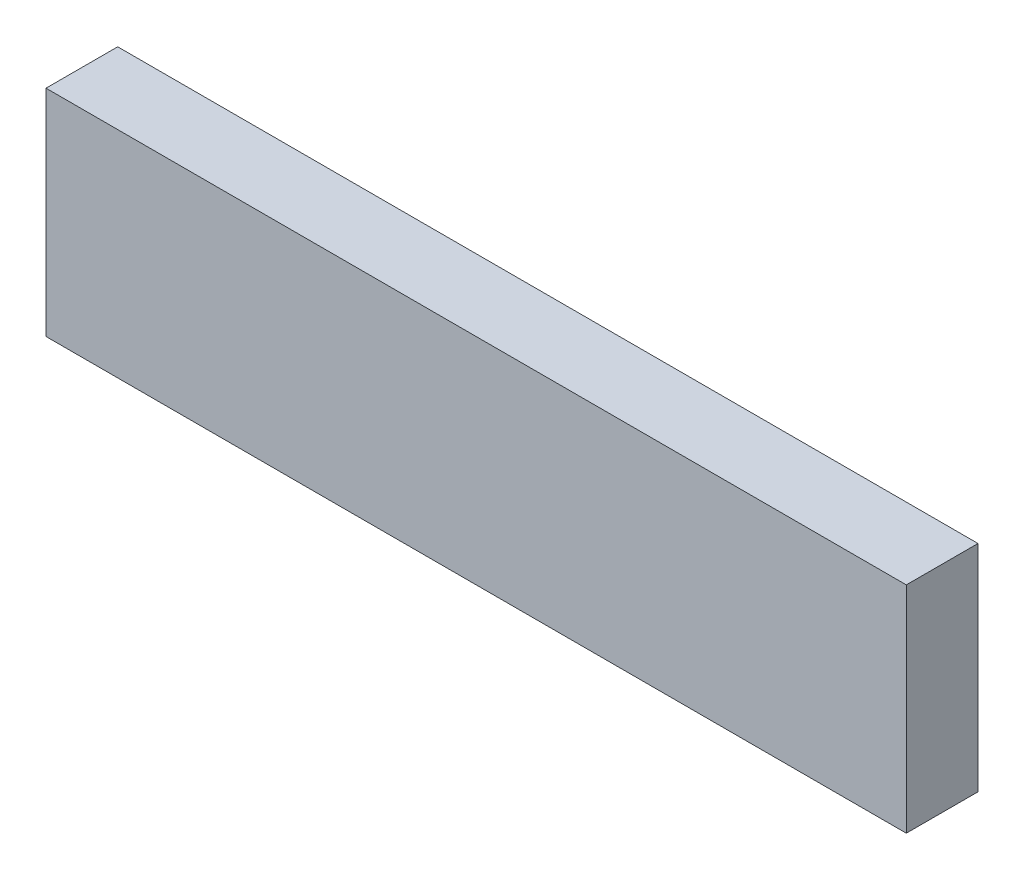
ISO-10303-21;
HEADER;
FILE_DESCRIPTION(('STEP AP214'),'2;1');
FILE_NAME('part.step','',(''),(''),'','','');
FILE_SCHEMA(('AUTOMOTIVE_DESIGN { 1 0 10303 214 1 1 1 1 }'));
ENDSEC;
DATA;
#1=APPLICATION_CONTEXT('core data for automotive mechanical design processes');
#2=APPLICATION_PROTOCOL_DEFINITION('international standard','automotive_design',2000,#1);
#3=PRODUCT_CONTEXT('',#1,'mechanical');
#4=PRODUCT('Part','Part','',(#3));
#5=PRODUCT_RELATED_PRODUCT_CATEGORY('part','',(#4));
#6=PRODUCT_DEFINITION_FORMATION('','',#4);
#7=PRODUCT_DEFINITION_CONTEXT('part definition',#1,'design');
#8=PRODUCT_DEFINITION('design','',#6,#7);
#9=PRODUCT_DEFINITION_SHAPE('','',#8);
#10=(LENGTH_UNIT() NAMED_UNIT(*) SI_UNIT(.MILLI.,.METRE.));
#11=(NAMED_UNIT(*) PLANE_ANGLE_UNIT() SI_UNIT($,.RADIAN.));
#12=(NAMED_UNIT(*) SI_UNIT($,.STERADIAN.) SOLID_ANGLE_UNIT());
#13=UNCERTAINTY_MEASURE_WITH_UNIT(LENGTH_MEASURE(1.E-05),#10,'distance_accuracy_value','');
#14=(GEOMETRIC_REPRESENTATION_CONTEXT(3) GLOBAL_UNCERTAINTY_ASSIGNED_CONTEXT((#13)) GLOBAL_UNIT_ASSIGNED_CONTEXT((#10,
#11,#12)) REPRESENTATION_CONTEXT('',''));
#15=CARTESIAN_POINT('',(0.,0.,0.));
#16=DIRECTION('',(0.,0.,1.));
#17=DIRECTION('',(1.,0.,0.));
#18=AXIS2_PLACEMENT_3D('',#15,#16,#17);
#19=CARTESIAN_POINT('',(0.,0.,5.));
#20=DIRECTION('',(1.,0.,0.));
#21=DIRECTION('',(0.,0.,-1.));
#22=AXIS2_PLACEMENT_3D('',#19,#20,#21);
#23=PLANE('',#22);
#24=DIRECTION('',(0.,-1.,0.));
#25=VECTOR('',#24,1.);
#26=CARTESIAN_POINT('',(0.,0.,0.));
#27=LINE('',#26,#25);
#28=CARTESIAN_POINT('',(0.,15.,0.));
#29=VERTEX_POINT('',#28);
#30=CARTESIAN_POINT('',(0.,0.,0.));
#31=VERTEX_POINT('',#30);
#32=EDGE_CURVE('E96',#29,#31,#27,.T.);
#33=ORIENTED_EDGE('',*,*,#32,.T.);
#34=DIRECTION('',(0.,0.,-1.));
#35=VECTOR('',#34,1.);
#36=CARTESIAN_POINT('',(0.,0.,5.));
#37=LINE('',#36,#35);
#38=CARTESIAN_POINT('',(0.,0.,5.));
#39=VERTEX_POINT('',#38);
#40=EDGE_CURVE('E11',#39,#31,#37,.T.);
#41=ORIENTED_EDGE('',*,*,#40,.F.);
#42=DIRECTION('',(0.,-1.,0.));
#43=VECTOR('',#42,1.);
#44=CARTESIAN_POINT('',(0.,0.,5.));
#45=LINE('',#44,#43);
#46=CARTESIAN_POINT('',(0.,15.,5.));
#47=VERTEX_POINT('',#46);
#48=EDGE_CURVE('E84',#47,#39,#45,.T.);
#49=ORIENTED_EDGE('',*,*,#48,.F.);
#50=DIRECTION('',(0.,0.,-1.));
#51=VECTOR('',#50,1.);
#52=CARTESIAN_POINT('',(0.,15.,5.));
#53=LINE('',#52,#51);
#54=EDGE_CURVE('E92',#47,#29,#53,.T.);
#55=ORIENTED_EDGE('',*,*,#54,.T.);
#56=EDGE_LOOP('',(#33,#41,#49,#55));
#57=FACE_BOUND('',#56,.T.);
#58=ADVANCED_FACE('F33',(#57),#23,.F.);
#59=CARTESIAN_POINT('',(0.,0.,5.));
#60=DIRECTION('',(0.,1.,0.));
#61=DIRECTION('',(0.,0.,1.));
#62=AXIS2_PLACEMENT_3D('',#59,#60,#61);
#63=PLANE('',#62);
#64=DIRECTION('',(1.,0.,0.));
#65=VECTOR('',#64,1.);
#66=CARTESIAN_POINT('',(0.,0.,0.));
#67=LINE('',#66,#65);
#68=CARTESIAN_POINT('',(60.,0.,0.));
#69=VERTEX_POINT('',#68);
#70=EDGE_CURVE('E88',#31,#69,#67,.T.);
#71=ORIENTED_EDGE('',*,*,#70,.T.);
#72=DIRECTION('',(0.,0.,-1.));
#73=VECTOR('',#72,1.);
#74=CARTESIAN_POINT('',(60.,0.,5.));
#75=LINE('',#74,#73);
#76=CARTESIAN_POINT('',(60.,0.,5.));
#77=VERTEX_POINT('',#76);
#78=EDGE_CURVE('E41',#77,#69,#75,.T.);
#79=ORIENTED_EDGE('',*,*,#78,.F.);
#80=DIRECTION('',(1.,0.,0.));
#81=VECTOR('',#80,1.);
#82=CARTESIAN_POINT('',(0.,0.,5.));
#83=LINE('',#82,#81);
#84=EDGE_CURVE('E79',#39,#77,#83,.T.);
#85=ORIENTED_EDGE('',*,*,#84,.F.);
#86=ORIENTED_EDGE('',*,*,#40,.T.);
#87=EDGE_LOOP('',(#71,#79,#85,#86));
#88=FACE_BOUND('',#87,.T.);
#89=ADVANCED_FACE('F87',(#88),#63,.F.);
#90=CARTESIAN_POINT('',(60.,0.,5.));
#91=DIRECTION('',(-1.,0.,0.));
#92=DIRECTION('',(0.,0.,1.));
#93=AXIS2_PLACEMENT_3D('',#90,#91,#92);
#94=PLANE('',#93);
#95=DIRECTION('',(0.,1.,0.));
#96=VECTOR('',#95,1.);
#97=CARTESIAN_POINT('',(60.,0.,0.));
#98=LINE('',#97,#96);
#99=CARTESIAN_POINT('',(60.,15.,0.));
#100=VERTEX_POINT('',#99);
#101=EDGE_CURVE('E66',#69,#100,#98,.T.);
#102=ORIENTED_EDGE('',*,*,#101,.T.);
#103=DIRECTION('',(0.,0.,-1.));
#104=VECTOR('',#103,1.);
#105=CARTESIAN_POINT('',(60.,15.,5.));
#106=LINE('',#105,#104);
#107=CARTESIAN_POINT('',(60.,15.,5.));
#108=VERTEX_POINT('',#107);
#109=EDGE_CURVE('E89',#108,#100,#106,.T.);
#110=ORIENTED_EDGE('',*,*,#109,.F.);
#111=DIRECTION('',(0.,1.,0.));
#112=VECTOR('',#111,1.);
#113=CARTESIAN_POINT('',(60.,0.,5.));
#114=LINE('',#113,#112);
#115=EDGE_CURVE('E82',#77,#108,#114,.T.);
#116=ORIENTED_EDGE('',*,*,#115,.F.);
#117=ORIENTED_EDGE('',*,*,#78,.T.);
#118=EDGE_LOOP('',(#102,#110,#116,#117));
#119=FACE_BOUND('',#118,.T.);
#120=ADVANCED_FACE('F90',(#119),#94,.F.);
#121=CARTESIAN_POINT('',(0.,15.,5.));
#122=DIRECTION('',(0.,-1.,0.));
#123=DIRECTION('',(0.,0.,-1.));
#124=AXIS2_PLACEMENT_3D('',#121,#122,#123);
#125=PLANE('',#124);
#126=DIRECTION('',(-1.,0.,0.));
#127=VECTOR('',#126,1.);
#128=CARTESIAN_POINT('',(0.,15.,0.));
#129=LINE('',#128,#127);
#130=EDGE_CURVE('E72',#100,#29,#129,.T.);
#131=ORIENTED_EDGE('',*,*,#130,.T.);
#132=ORIENTED_EDGE('',*,*,#54,.F.);
#133=DIRECTION('',(-1.,0.,0.));
#134=VECTOR('',#133,1.);
#135=CARTESIAN_POINT('',(0.,15.,5.));
#136=LINE('',#135,#134);
#137=EDGE_CURVE('E49',#108,#47,#136,.T.);
#138=ORIENTED_EDGE('',*,*,#137,.F.);
#139=ORIENTED_EDGE('',*,*,#109,.T.);
#140=EDGE_LOOP('',(#131,#132,#138,#139));
#141=FACE_BOUND('',#140,.T.);
#142=ADVANCED_FACE('F103',(#141),#125,.F.);
#143=CARTESIAN_POINT('',(0.,0.,5.));
#144=DIRECTION('',(0.,0.,-1.));
#145=DIRECTION('',(-1.,0.,0.));
#146=AXIS2_PLACEMENT_3D('',#143,#144,#145);
#147=PLANE('',#146);
#148=ORIENTED_EDGE('',*,*,#48,.T.);
#149=ORIENTED_EDGE('',*,*,#84,.T.);
#150=ORIENTED_EDGE('',*,*,#115,.T.);
#151=ORIENTED_EDGE('',*,*,#137,.T.);
#152=EDGE_LOOP('',(#148,#149,#150,#151));
#153=FACE_BOUND('',#152,.T.);
#154=ADVANCED_FACE('F80',(#153),#147,.F.);
#155=CARTESIAN_POINT('',(0.,0.,0.));
#156=DIRECTION('',(0.,0.,-1.));
#157=DIRECTION('',(-1.,0.,0.));
#158=AXIS2_PLACEMENT_3D('',#155,#156,#157);
#159=PLANE('',#158);
#160=ORIENTED_EDGE('',*,*,#32,.F.);
#161=ORIENTED_EDGE('',*,*,#130,.F.);
#162=ORIENTED_EDGE('',*,*,#101,.F.);
#163=ORIENTED_EDGE('',*,*,#70,.F.);
#164=EDGE_LOOP('',(#160,#161,#162,#163));
#165=FACE_BOUND('',#164,.T.);
#166=ADVANCED_FACE('F106',(#165),#159,.T.);
#167=CLOSED_SHELL('',(#58,#89,#120,#142,#154,#166));
#168=MANIFOLD_SOLID_BREP('B2',#167);
#169=ADVANCED_BREP_SHAPE_REPRESENTATION('',(#18,#168),#14);
#170=SHAPE_DEFINITION_REPRESENTATION(#9,#169);
ENDSEC;
END-ISO-10303-21;
